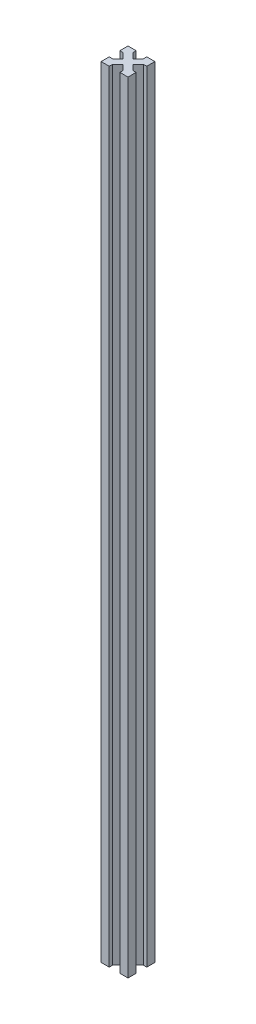
ISO-10303-21;
HEADER;
FILE_DESCRIPTION(('STEP AP214'),'2;1');
FILE_NAME('part.step','',(''),(''),'','','');
FILE_SCHEMA(('AUTOMOTIVE_DESIGN { 1 0 10303 214 1 1 1 1 }'));
ENDSEC;
DATA;
#1=APPLICATION_CONTEXT('core data for automotive mechanical design processes');
#2=APPLICATION_PROTOCOL_DEFINITION('international standard','automotive_design',2000,#1);
#3=PRODUCT_CONTEXT('',#1,'mechanical');
#4=PRODUCT('Part','Part','',(#3));
#5=PRODUCT_RELATED_PRODUCT_CATEGORY('part','',(#4));
#6=PRODUCT_DEFINITION_FORMATION('','',#4);
#7=PRODUCT_DEFINITION_CONTEXT('part definition',#1,'design');
#8=PRODUCT_DEFINITION('design','',#6,#7);
#9=PRODUCT_DEFINITION_SHAPE('','',#8);
#10=(LENGTH_UNIT() NAMED_UNIT(*) SI_UNIT(.MILLI.,.METRE.));
#11=(NAMED_UNIT(*) PLANE_ANGLE_UNIT() SI_UNIT($,.RADIAN.));
#12=(NAMED_UNIT(*) SI_UNIT($,.STERADIAN.) SOLID_ANGLE_UNIT());
#13=UNCERTAINTY_MEASURE_WITH_UNIT(LENGTH_MEASURE(1.E-05),#10,'distance_accuracy_value','');
#14=(GEOMETRIC_REPRESENTATION_CONTEXT(3) GLOBAL_UNCERTAINTY_ASSIGNED_CONTEXT((#13)) GLOBAL_UNIT_ASSIGNED_CONTEXT((#10,
#11,#12)) REPRESENTATION_CONTEXT('',''));
#15=CARTESIAN_POINT('',(0.,0.,0.));
#16=DIRECTION('',(0.,0.,1.));
#17=DIRECTION('',(1.,0.,0.));
#18=AXIS2_PLACEMENT_3D('',#15,#16,#17);
#19=CARTESIAN_POINT('',(-11.7677669529664,580.,-11.7677669529664));
#20=DIRECTION('',(0.707106781186548,0.,0.707106781186547));
#21=DIRECTION('',(0.707106781186547,0.,-0.707106781186548));
#22=AXIS2_PLACEMENT_3D('',#19,#20,#21);
#23=PLANE('',#22);
#24=DIRECTION('',(-0.707106781186547,0.,0.707106781186548));
#25=VECTOR('',#24,1.);
#26=CARTESIAN_POINT('',(-11.7677669529664,0.,-11.7677669529664));
#27=LINE('',#26,#25);
#28=CARTESIAN_POINT('',(-13.5355339059327,0.,-10.));
#29=VERTEX_POINT('',#28);
#30=CARTESIAN_POINT('',(-17.5,0.,-6.03553390593274));
#31=VERTEX_POINT('',#30);
#32=EDGE_CURVE('E231',#29,#31,#27,.T.);
#33=ORIENTED_EDGE('',*,*,#32,.T.);
#34=DIRECTION('',(0.,-1.,0.));
#35=VECTOR('',#34,1.);
#36=CARTESIAN_POINT('',(-17.5,580.,-6.03553390593274));
#37=LINE('',#36,#35);
#38=CARTESIAN_POINT('',(-17.5,580.,-6.03553390593274));
#39=VERTEX_POINT('',#38);
#40=EDGE_CURVE('E11',#39,#31,#37,.T.);
#41=ORIENTED_EDGE('',*,*,#40,.F.);
#42=DIRECTION('',(-0.707106781186547,0.,0.707106781186548));
#43=VECTOR('',#42,1.);
#44=CARTESIAN_POINT('',(-11.7677669529664,580.,-11.7677669529664));
#45=LINE('',#44,#43);
#46=CARTESIAN_POINT('',(-13.5355339059327,580.,-10.));
#47=VERTEX_POINT('',#46);
#48=EDGE_CURVE('E294',#47,#39,#45,.T.);
#49=ORIENTED_EDGE('',*,*,#48,.F.);
#50=DIRECTION('',(0.,-1.,0.));
#51=VECTOR('',#50,1.);
#52=CARTESIAN_POINT('',(-13.5355339059327,580.,-10.));
#53=LINE('',#52,#51);
#54=EDGE_CURVE('E227',#47,#29,#53,.T.);
#55=ORIENTED_EDGE('',*,*,#54,.T.);
#56=EDGE_LOOP('',(#33,#41,#49,#55));
#57=FACE_BOUND('',#56,.T.);
#58=ADVANCED_FACE('F41',(#57),#23,.F.);
#59=CARTESIAN_POINT('',(0.,580.,-6.03553390593274));
#60=DIRECTION('',(0.,0.,1.));
#61=DIRECTION('',(1.,0.,0.));
#62=AXIS2_PLACEMENT_3D('',#59,#60,#61);
#63=PLANE('',#62);
#64=DIRECTION('',(-1.,0.,0.));
#65=VECTOR('',#64,1.);
#66=CARTESIAN_POINT('',(0.,0.,-6.03553390593274));
#67=LINE('',#66,#65);
#68=CARTESIAN_POINT('',(-20.,0.,-6.03553390593274));
#69=VERTEX_POINT('',#68);
#70=EDGE_CURVE('E234',#31,#69,#67,.T.);
#71=ORIENTED_EDGE('',*,*,#70,.T.);
#72=DIRECTION('',(0.,-1.,0.));
#73=VECTOR('',#72,1.);
#74=CARTESIAN_POINT('',(-20.,580.,-6.03553390593274));
#75=LINE('',#74,#73);
#76=CARTESIAN_POINT('',(-20.,580.,-6.03553390593274));
#77=VERTEX_POINT('',#76);
#78=EDGE_CURVE('E49',#77,#69,#75,.T.);
#79=ORIENTED_EDGE('',*,*,#78,.F.);
#80=DIRECTION('',(-1.,0.,0.));
#81=VECTOR('',#80,1.);
#82=CARTESIAN_POINT('',(0.,580.,-6.03553390593274));
#83=LINE('',#82,#81);
#84=EDGE_CURVE('E144',#39,#77,#83,.T.);
#85=ORIENTED_EDGE('',*,*,#84,.F.);
#86=ORIENTED_EDGE('',*,*,#40,.T.);
#87=EDGE_LOOP('',(#71,#79,#85,#86));
#88=FACE_BOUND('',#87,.T.);
#89=ADVANCED_FACE('F343',(#88),#63,.F.);
#90=CARTESIAN_POINT('',(-20.,580.,0.));
#91=DIRECTION('',(-1.,0.,0.));
#92=DIRECTION('',(0.,0.,1.));
#93=AXIS2_PLACEMENT_3D('',#90,#91,#92);
#94=PLANE('',#93);
#95=DIRECTION('',(0.,0.,-1.));
#96=VECTOR('',#95,1.);
#97=CARTESIAN_POINT('',(-20.,0.,0.));
#98=LINE('',#97,#96);
#99=CARTESIAN_POINT('',(-20.,0.,0.));
#100=VERTEX_POINT('',#99);
#101=EDGE_CURVE('E237',#100,#69,#98,.T.);
#102=ORIENTED_EDGE('',*,*,#101,.F.);
#103=DIRECTION('',(0.,-1.,0.));
#104=VECTOR('',#103,1.);
#105=CARTESIAN_POINT('',(-20.,580.,0.));
#106=LINE('',#105,#104);
#107=CARTESIAN_POINT('',(-20.,580.,0.));
#108=VERTEX_POINT('',#107);
#109=EDGE_CURVE('E336',#108,#100,#106,.T.);
#110=ORIENTED_EDGE('',*,*,#109,.F.);
#111=DIRECTION('',(0.,0.,-1.));
#112=VECTOR('',#111,1.);
#113=CARTESIAN_POINT('',(-20.,580.,0.));
#114=LINE('',#113,#112);
#115=EDGE_CURVE('E342',#108,#77,#114,.T.);
#116=ORIENTED_EDGE('',*,*,#115,.T.);
#117=ORIENTED_EDGE('',*,*,#78,.T.);
#118=EDGE_LOOP('',(#102,#110,#116,#117));
#119=FACE_BOUND('',#118,.T.);
#120=ADVANCED_FACE('F340',(#119),#94,.T.);
#121=CARTESIAN_POINT('',(0.,580.,0.));
#122=DIRECTION('',(0.,0.,1.));
#123=DIRECTION('',(1.,0.,0.));
#124=AXIS2_PLACEMENT_3D('',#121,#122,#123);
#125=PLANE('',#124);
#126=DIRECTION('',(-1.,0.,0.));
#127=VECTOR('',#126,1.);
#128=CARTESIAN_POINT('',(0.,0.,0.));
#129=LINE('',#128,#127);
#130=CARTESIAN_POINT('',(-13.9644660940673,0.,0.));
#131=VERTEX_POINT('',#130);
#132=EDGE_CURVE('E240',#131,#100,#129,.T.);
#133=ORIENTED_EDGE('',*,*,#132,.F.);
#134=DIRECTION('',(0.,-1.,0.));
#135=VECTOR('',#134,1.);
#136=CARTESIAN_POINT('',(-13.9644660940673,580.,0.));
#137=LINE('',#136,#135);
#138=CARTESIAN_POINT('',(-13.9644660940673,580.,0.));
#139=VERTEX_POINT('',#138);
#140=EDGE_CURVE('E334',#139,#131,#137,.T.);
#141=ORIENTED_EDGE('',*,*,#140,.F.);
#142=DIRECTION('',(-1.,0.,0.));
#143=VECTOR('',#142,1.);
#144=CARTESIAN_POINT('',(0.,580.,0.));
#145=LINE('',#144,#143);
#146=EDGE_CURVE('E354',#139,#108,#145,.T.);
#147=ORIENTED_EDGE('',*,*,#146,.T.);
#148=ORIENTED_EDGE('',*,*,#109,.T.);
#149=EDGE_LOOP('',(#133,#141,#147,#148));
#150=FACE_BOUND('',#149,.T.);
#151=ADVANCED_FACE('F351',(#150),#125,.T.);
#152=CARTESIAN_POINT('',(-13.9644660940673,580.,0.));
#153=DIRECTION('',(1.,0.,0.));
#154=DIRECTION('',(0.,0.,-1.));
#155=AXIS2_PLACEMENT_3D('',#152,#153,#154);
#156=PLANE('',#155);
#157=DIRECTION('',(0.,0.,1.));
#158=VECTOR('',#157,1.);
#159=CARTESIAN_POINT('',(-13.9644660940673,0.,0.));
#160=LINE('',#159,#158);
#161=CARTESIAN_POINT('',(-13.9644660940673,0.,-2.5));
#162=VERTEX_POINT('',#161);
#163=EDGE_CURVE('E243',#162,#131,#160,.T.);
#164=ORIENTED_EDGE('',*,*,#163,.F.);
#165=DIRECTION('',(0.,-1.,0.));
#166=VECTOR('',#165,1.);
#167=CARTESIAN_POINT('',(-13.9644660940673,580.,-2.5));
#168=LINE('',#167,#166);
#169=CARTESIAN_POINT('',(-13.9644660940673,580.,-2.5));
#170=VERTEX_POINT('',#169);
#171=EDGE_CURVE('E332',#170,#162,#168,.T.);
#172=ORIENTED_EDGE('',*,*,#171,.F.);
#173=DIRECTION('',(0.,0.,1.));
#174=VECTOR('',#173,1.);
#175=CARTESIAN_POINT('',(-13.9644660940673,580.,0.));
#176=LINE('',#175,#174);
#177=EDGE_CURVE('E358',#170,#139,#176,.T.);
#178=ORIENTED_EDGE('',*,*,#177,.T.);
#179=ORIENTED_EDGE('',*,*,#140,.T.);
#180=EDGE_LOOP('',(#164,#172,#178,#179));
#181=FACE_BOUND('',#180,.T.);
#182=ADVANCED_FACE('F432',(#181),#156,.T.);
#183=CARTESIAN_POINT('',(-8.23223304703363,580.,-8.23223304703363));
#184=DIRECTION('',(0.707106781186548,0.,0.707106781186547));
#185=DIRECTION('',(0.707106781186547,0.,-0.707106781186548));
#186=AXIS2_PLACEMENT_3D('',#183,#184,#185);
#187=PLANE('',#186);
#188=DIRECTION('',(-0.707106781186547,0.,0.707106781186548));
#189=VECTOR('',#188,1.);
#190=CARTESIAN_POINT('',(-8.23223304703363,0.,-8.23223304703363));
#191=LINE('',#190,#189);
#192=CARTESIAN_POINT('',(-10.,0.,-6.46446609406726));
#193=VERTEX_POINT('',#192);
#194=EDGE_CURVE('E246',#193,#162,#191,.T.);
#195=ORIENTED_EDGE('',*,*,#194,.F.);
#196=DIRECTION('',(0.,-1.,0.));
#197=VECTOR('',#196,1.);
#198=CARTESIAN_POINT('',(-10.,580.,-6.46446609406726));
#199=LINE('',#198,#197);
#200=CARTESIAN_POINT('',(-10.,580.,-6.46446609406726));
#201=VERTEX_POINT('',#200);
#202=EDGE_CURVE('E330',#201,#193,#199,.T.);
#203=ORIENTED_EDGE('',*,*,#202,.F.);
#204=DIRECTION('',(-0.707106781186547,0.,0.707106781186548));
#205=VECTOR('',#204,1.);
#206=CARTESIAN_POINT('',(-8.23223304703363,580.,-8.23223304703363));
#207=LINE('',#206,#205);
#208=EDGE_CURVE('E364',#201,#170,#207,.T.);
#209=ORIENTED_EDGE('',*,*,#208,.T.);
#210=ORIENTED_EDGE('',*,*,#171,.T.);
#211=EDGE_LOOP('',(#195,#203,#209,#210));
#212=FACE_BOUND('',#211,.T.);
#213=ADVANCED_FACE('F435',(#212),#187,.T.);
#214=CARTESIAN_POINT('',(-1.76776695296637,580.,1.76776695296637));
#215=DIRECTION('',(0.707106781186548,0.,-0.707106781186548));
#216=DIRECTION('',(-0.707106781186548,0.,-0.707106781186548));
#217=AXIS2_PLACEMENT_3D('',#214,#215,#216);
#218=PLANE('',#217);
#219=DIRECTION('',(0.707106781186548,0.,0.707106781186548));
#220=VECTOR('',#219,1.);
#221=CARTESIAN_POINT('',(-1.76776695296637,0.,1.76776695296637));
#222=LINE('',#221,#220);
#223=CARTESIAN_POINT('',(-6.03553390593274,0.,-2.5));
#224=VERTEX_POINT('',#223);
#225=EDGE_CURVE('E249',#193,#224,#222,.T.);
#226=ORIENTED_EDGE('',*,*,#225,.T.);
#227=DIRECTION('',(0.,-1.,0.));
#228=VECTOR('',#227,1.);
#229=CARTESIAN_POINT('',(-6.03553390593274,580.,-2.5));
#230=LINE('',#229,#228);
#231=CARTESIAN_POINT('',(-6.03553390593274,580.,-2.5));
#232=VERTEX_POINT('',#231);
#233=EDGE_CURVE('E327',#232,#224,#230,.T.);
#234=ORIENTED_EDGE('',*,*,#233,.F.);
#235=DIRECTION('',(0.707106781186548,0.,0.707106781186548));
#236=VECTOR('',#235,1.);
#237=CARTESIAN_POINT('',(-1.76776695296637,580.,1.76776695296637));
#238=LINE('',#237,#236);
#239=EDGE_CURVE('E367',#201,#232,#238,.T.);
#240=ORIENTED_EDGE('',*,*,#239,.F.);
#241=ORIENTED_EDGE('',*,*,#202,.T.);
#242=EDGE_LOOP('',(#226,#234,#240,#241));
#243=FACE_BOUND('',#242,.T.);
#244=ADVANCED_FACE('F439',(#243),#218,.F.);
#245=CARTESIAN_POINT('',(-6.03553390593274,580.,0.));
#246=DIRECTION('',(1.,0.,0.));
#247=DIRECTION('',(0.,0.,-1.));
#248=AXIS2_PLACEMENT_3D('',#245,#246,#247);
#249=PLANE('',#248);
#250=DIRECTION('',(0.,0.,1.));
#251=VECTOR('',#250,1.);
#252=CARTESIAN_POINT('',(-6.03553390593274,0.,0.));
#253=LINE('',#252,#251);
#254=CARTESIAN_POINT('',(-6.03553390593274,0.,0.));
#255=VERTEX_POINT('',#254);
#256=EDGE_CURVE('E251',#224,#255,#253,.T.);
#257=ORIENTED_EDGE('',*,*,#256,.T.);
#258=DIRECTION('',(0.,-1.,0.));
#259=VECTOR('',#258,1.);
#260=CARTESIAN_POINT('',(-6.03553390593274,580.,0.));
#261=LINE('',#260,#259);
#262=CARTESIAN_POINT('',(-6.03553390593274,580.,0.));
#263=VERTEX_POINT('',#262);
#264=EDGE_CURVE('E325',#263,#255,#261,.T.);
#265=ORIENTED_EDGE('',*,*,#264,.F.);
#266=DIRECTION('',(0.,0.,1.));
#267=VECTOR('',#266,1.);
#268=CARTESIAN_POINT('',(-6.03553390593274,580.,0.));
#269=LINE('',#268,#267);
#270=EDGE_CURVE('E369',#232,#263,#269,.T.);
#271=ORIENTED_EDGE('',*,*,#270,.F.);
#272=ORIENTED_EDGE('',*,*,#233,.T.);
#273=EDGE_LOOP('',(#257,#265,#271,#272));
#274=FACE_BOUND('',#273,.T.);
#275=ADVANCED_FACE('F443',(#274),#249,.F.);
#276=CARTESIAN_POINT('',(0.,580.,0.));
#277=DIRECTION('',(0.,0.,1.));
#278=DIRECTION('',(1.,0.,0.));
#279=AXIS2_PLACEMENT_3D('',#276,#277,#278);
#280=PLANE('',#279);
#281=DIRECTION('',(-1.,0.,0.));
#282=VECTOR('',#281,1.);
#283=CARTESIAN_POINT('',(0.,0.,0.));
#284=LINE('',#283,#282);
#285=CARTESIAN_POINT('',(0.,0.,0.));
#286=VERTEX_POINT('',#285);
#287=EDGE_CURVE('E254',#286,#255,#284,.T.);
#288=ORIENTED_EDGE('',*,*,#287,.F.);
#289=DIRECTION('',(0.,-1.,0.));
#290=VECTOR('',#289,1.);
#291=CARTESIAN_POINT('',(0.,580.,0.));
#292=LINE('',#291,#290);
#293=CARTESIAN_POINT('',(0.,580.,0.));
#294=VERTEX_POINT('',#293);
#295=EDGE_CURVE('E323',#294,#286,#292,.T.);
#296=ORIENTED_EDGE('',*,*,#295,.F.);
#297=DIRECTION('',(-1.,0.,0.));
#298=VECTOR('',#297,1.);
#299=CARTESIAN_POINT('',(0.,580.,0.));
#300=LINE('',#299,#298);
#301=EDGE_CURVE('E371',#294,#263,#300,.T.);
#302=ORIENTED_EDGE('',*,*,#301,.T.);
#303=ORIENTED_EDGE('',*,*,#264,.T.);
#304=EDGE_LOOP('',(#288,#296,#302,#303));
#305=FACE_BOUND('',#304,.T.);
#306=ADVANCED_FACE('F447',(#305),#280,.T.);
#307=CARTESIAN_POINT('',(0.,580.,0.));
#308=DIRECTION('',(-1.,0.,0.));
#309=DIRECTION('',(0.,0.,1.));
#310=AXIS2_PLACEMENT_3D('',#307,#308,#309);
#311=PLANE('',#310);
#312=DIRECTION('',(0.,0.,-1.));
#313=VECTOR('',#312,1.);
#314=CARTESIAN_POINT('',(0.,0.,0.));
#315=LINE('',#314,#313);
#316=CARTESIAN_POINT('',(0.,0.,-6.03553390593274));
#317=VERTEX_POINT('',#316);
#318=EDGE_CURVE('E257',#286,#317,#315,.T.);
#319=ORIENTED_EDGE('',*,*,#318,.T.);
#320=DIRECTION('',(0.,-1.,0.));
#321=VECTOR('',#320,1.);
#322=CARTESIAN_POINT('',(0.,580.,-6.03553390593274));
#323=LINE('',#322,#321);
#324=CARTESIAN_POINT('',(0.,580.,-6.03553390593274));
#325=VERTEX_POINT('',#324);
#326=EDGE_CURVE('E321',#325,#317,#323,.T.);
#327=ORIENTED_EDGE('',*,*,#326,.F.);
#328=DIRECTION('',(0.,0.,-1.));
#329=VECTOR('',#328,1.);
#330=CARTESIAN_POINT('',(0.,580.,0.));
#331=LINE('',#330,#329);
#332=EDGE_CURVE('E374',#294,#325,#331,.T.);
#333=ORIENTED_EDGE('',*,*,#332,.F.);
#334=ORIENTED_EDGE('',*,*,#295,.T.);
#335=EDGE_LOOP('',(#319,#327,#333,#334));
#336=FACE_BOUND('',#335,.T.);
#337=ADVANCED_FACE('F451',(#336),#311,.F.);
#338=CARTESIAN_POINT('',(0.,580.,-6.03553390593275));
#339=DIRECTION('',(0.,0.,-1.));
#340=DIRECTION('',(-1.,0.,0.));
#341=AXIS2_PLACEMENT_3D('',#338,#339,#340);
#342=PLANE('',#341);
#343=DIRECTION('',(1.,0.,0.));
#344=VECTOR('',#343,1.);
#345=CARTESIAN_POINT('',(0.,0.,-6.03553390593275));
#346=LINE('',#345,#344);
#347=CARTESIAN_POINT('',(-2.5,0.,-6.03553390593275));
#348=VERTEX_POINT('',#347);
#349=EDGE_CURVE('E260',#348,#317,#346,.T.);
#350=ORIENTED_EDGE('',*,*,#349,.F.);
#351=DIRECTION('',(0.,-1.,0.));
#352=VECTOR('',#351,1.);
#353=CARTESIAN_POINT('',(-2.5,580.,-6.03553390593275));
#354=LINE('',#353,#352);
#355=CARTESIAN_POINT('',(-2.5,580.,-6.03553390593275));
#356=VERTEX_POINT('',#355);
#357=EDGE_CURVE('E319',#356,#348,#354,.T.);
#358=ORIENTED_EDGE('',*,*,#357,.F.);
#359=DIRECTION('',(1.,0.,0.));
#360=VECTOR('',#359,1.);
#361=CARTESIAN_POINT('',(0.,580.,-6.03553390593275));
#362=LINE('',#361,#360);
#363=EDGE_CURVE('E376',#356,#325,#362,.T.);
#364=ORIENTED_EDGE('',*,*,#363,.T.);
#365=ORIENTED_EDGE('',*,*,#326,.T.);
#366=EDGE_LOOP('',(#350,#358,#364,#365));
#367=FACE_BOUND('',#366,.T.);
#368=ADVANCED_FACE('F455',(#367),#342,.T.);
#369=CARTESIAN_POINT('',(1.76776695296637,580.,-1.76776695296638));
#370=DIRECTION('',(0.707106781186547,0.,-0.707106781186548));
#371=DIRECTION('',(-0.707106781186548,0.,-0.707106781186547));
#372=AXIS2_PLACEMENT_3D('',#369,#370,#371);
#373=PLANE('',#372);
#374=DIRECTION('',(0.707106781186548,0.,0.707106781186547));
#375=VECTOR('',#374,1.);
#376=CARTESIAN_POINT('',(1.76776695296637,0.,-1.76776695296638));
#377=LINE('',#376,#375);
#378=CARTESIAN_POINT('',(-6.46446609406726,0.,-10.));
#379=VERTEX_POINT('',#378);
#380=EDGE_CURVE('E263',#379,#348,#377,.T.);
#381=ORIENTED_EDGE('',*,*,#380,.F.);
#382=DIRECTION('',(0.,-1.,0.));
#383=VECTOR('',#382,1.);
#384=CARTESIAN_POINT('',(-6.46446609406726,580.,-10.));
#385=LINE('',#384,#383);
#386=CARTESIAN_POINT('',(-6.46446609406726,580.,-10.));
#387=VERTEX_POINT('',#386);
#388=EDGE_CURVE('E317',#387,#379,#385,.T.);
#389=ORIENTED_EDGE('',*,*,#388,.F.);
#390=DIRECTION('',(0.707106781186548,0.,0.707106781186547));
#391=VECTOR('',#390,1.);
#392=CARTESIAN_POINT('',(1.76776695296637,580.,-1.76776695296638));
#393=LINE('',#392,#391);
#394=EDGE_CURVE('E379',#387,#356,#393,.T.);
#395=ORIENTED_EDGE('',*,*,#394,.T.);
#396=ORIENTED_EDGE('',*,*,#357,.T.);
#397=EDGE_LOOP('',(#381,#389,#395,#396));
#398=FACE_BOUND('',#397,.T.);
#399=ADVANCED_FACE('F459',(#398),#373,.T.);
#400=CARTESIAN_POINT('',(-8.23223304703363,580.,-8.23223304703363));
#401=DIRECTION('',(0.707106781186548,0.,0.707106781186547));
#402=DIRECTION('',(0.707106781186547,0.,-0.707106781186548));
#403=AXIS2_PLACEMENT_3D('',#400,#401,#402);
#404=PLANE('',#403);
#405=DIRECTION('',(-0.707106781186547,0.,0.707106781186548));
#406=VECTOR('',#405,1.);
#407=CARTESIAN_POINT('',(-8.23223304703363,0.,-8.23223304703363));
#408=LINE('',#407,#406);
#409=CARTESIAN_POINT('',(-2.5,0.,-13.9644660940673));
#410=VERTEX_POINT('',#409);
#411=EDGE_CURVE('E266',#410,#379,#408,.T.);
#412=ORIENTED_EDGE('',*,*,#411,.F.);
#413=DIRECTION('',(0.,-1.,0.));
#414=VECTOR('',#413,1.);
#415=CARTESIAN_POINT('',(-2.5,580.,-13.9644660940673));
#416=LINE('',#415,#414);
#417=CARTESIAN_POINT('',(-2.5,580.,-13.9644660940673));
#418=VERTEX_POINT('',#417);
#419=EDGE_CURVE('E315',#418,#410,#416,.T.);
#420=ORIENTED_EDGE('',*,*,#419,.F.);
#421=DIRECTION('',(-0.707106781186547,0.,0.707106781186548));
#422=VECTOR('',#421,1.);
#423=CARTESIAN_POINT('',(-8.23223304703363,580.,-8.23223304703363));
#424=LINE('',#423,#422);
#425=EDGE_CURVE('E382',#418,#387,#424,.T.);
#426=ORIENTED_EDGE('',*,*,#425,.T.);
#427=ORIENTED_EDGE('',*,*,#388,.T.);
#428=EDGE_LOOP('',(#412,#420,#426,#427));
#429=FACE_BOUND('',#428,.T.);
#430=ADVANCED_FACE('F463',(#429),#404,.T.);
#431=CARTESIAN_POINT('',(0.,580.,-13.9644660940673));
#432=DIRECTION('',(0.,0.,-1.));
#433=DIRECTION('',(-1.,0.,0.));
#434=AXIS2_PLACEMENT_3D('',#431,#432,#433);
#435=PLANE('',#434);
#436=DIRECTION('',(1.,0.,0.));
#437=VECTOR('',#436,1.);
#438=CARTESIAN_POINT('',(0.,0.,-13.9644660940673));
#439=LINE('',#438,#437);
#440=CARTESIAN_POINT('',(0.,0.,-13.9644660940673));
#441=VERTEX_POINT('',#440);
#442=EDGE_CURVE('E269',#410,#441,#439,.T.);
#443=ORIENTED_EDGE('',*,*,#442,.T.);
#444=DIRECTION('',(0.,-1.,0.));
#445=VECTOR('',#444,1.);
#446=CARTESIAN_POINT('',(0.,580.,-13.9644660940673));
#447=LINE('',#446,#445);
#448=CARTESIAN_POINT('',(0.,580.,-13.9644660940673));
#449=VERTEX_POINT('',#448);
#450=EDGE_CURVE('E312',#449,#441,#447,.T.);
#451=ORIENTED_EDGE('',*,*,#450,.F.);
#452=DIRECTION('',(1.,0.,0.));
#453=VECTOR('',#452,1.);
#454=CARTESIAN_POINT('',(0.,580.,-13.9644660940673));
#455=LINE('',#454,#453);
#456=EDGE_CURVE('E385',#418,#449,#455,.T.);
#457=ORIENTED_EDGE('',*,*,#456,.F.);
#458=ORIENTED_EDGE('',*,*,#419,.T.);
#459=EDGE_LOOP('',(#443,#451,#457,#458));
#460=FACE_BOUND('',#459,.T.);
#461=ADVANCED_FACE('F467',(#460),#435,.F.);
#462=CARTESIAN_POINT('',(0.,580.,0.));
#463=DIRECTION('',(-1.,0.,0.));
#464=DIRECTION('',(0.,0.,1.));
#465=AXIS2_PLACEMENT_3D('',#462,#463,#464);
#466=PLANE('',#465);
#467=DIRECTION('',(0.,0.,-1.));
#468=VECTOR('',#467,1.);
#469=CARTESIAN_POINT('',(0.,0.,0.));
#470=LINE('',#469,#468);
#471=CARTESIAN_POINT('',(0.,0.,-20.));
#472=VERTEX_POINT('',#471);
#473=EDGE_CURVE('E271',#441,#472,#470,.T.);
#474=ORIENTED_EDGE('',*,*,#473,.T.);
#475=DIRECTION('',(0.,-1.,0.));
#476=VECTOR('',#475,1.);
#477=CARTESIAN_POINT('',(0.,580.,-20.));
#478=LINE('',#477,#476);
#479=CARTESIAN_POINT('',(0.,580.,-20.));
#480=VERTEX_POINT('',#479);
#481=EDGE_CURVE('E309',#480,#472,#478,.T.);
#482=ORIENTED_EDGE('',*,*,#481,.F.);
#483=DIRECTION('',(0.,0.,-1.));
#484=VECTOR('',#483,1.);
#485=CARTESIAN_POINT('',(0.,580.,0.));
#486=LINE('',#485,#484);
#487=EDGE_CURVE('E387',#449,#480,#486,.T.);
#488=ORIENTED_EDGE('',*,*,#487,.F.);
#489=ORIENTED_EDGE('',*,*,#450,.T.);
#490=EDGE_LOOP('',(#474,#482,#488,#489));
#491=FACE_BOUND('',#490,.T.);
#492=ADVANCED_FACE('F471',(#491),#466,.F.);
#493=CARTESIAN_POINT('',(0.,580.,-20.));
#494=DIRECTION('',(0.,0.,1.));
#495=DIRECTION('',(1.,0.,0.));
#496=AXIS2_PLACEMENT_3D('',#493,#494,#495);
#497=PLANE('',#496);
#498=DIRECTION('',(-1.,0.,0.));
#499=VECTOR('',#498,1.);
#500=CARTESIAN_POINT('',(0.,0.,-20.));
#501=LINE('',#500,#499);
#502=CARTESIAN_POINT('',(-6.03553390593274,0.,-20.));
#503=VERTEX_POINT('',#502);
#504=EDGE_CURVE('E273',#472,#503,#501,.T.);
#505=ORIENTED_EDGE('',*,*,#504,.T.);
#506=DIRECTION('',(0.,-1.,0.));
#507=VECTOR('',#506,1.);
#508=CARTESIAN_POINT('',(-6.03553390593274,580.,-20.));
#509=LINE('',#508,#507);
#510=CARTESIAN_POINT('',(-6.03553390593274,580.,-20.));
#511=VERTEX_POINT('',#510);
#512=EDGE_CURVE('E307',#511,#503,#509,.T.);
#513=ORIENTED_EDGE('',*,*,#512,.F.);
#514=DIRECTION('',(-1.,0.,0.));
#515=VECTOR('',#514,1.);
#516=CARTESIAN_POINT('',(0.,580.,-20.));
#517=LINE('',#516,#515);
#518=EDGE_CURVE('E389',#480,#511,#517,.T.);
#519=ORIENTED_EDGE('',*,*,#518,.F.);
#520=ORIENTED_EDGE('',*,*,#481,.T.);
#521=EDGE_LOOP('',(#505,#513,#519,#520));
#522=FACE_BOUND('',#521,.T.);
#523=ADVANCED_FACE('F475',(#522),#497,.F.);
#524=CARTESIAN_POINT('',(-6.03553390593275,580.,0.));
#525=DIRECTION('',(-1.,0.,0.));
#526=DIRECTION('',(0.,0.,1.));
#527=AXIS2_PLACEMENT_3D('',#524,#525,#526);
#528=PLANE('',#527);
#529=DIRECTION('',(0.,0.,-1.));
#530=VECTOR('',#529,1.);
#531=CARTESIAN_POINT('',(-6.03553390593275,0.,0.));
#532=LINE('',#531,#530);
#533=CARTESIAN_POINT('',(-6.03553390593274,0.,-17.5));
#534=VERTEX_POINT('',#533);
#535=EDGE_CURVE('E276',#534,#503,#532,.T.);
#536=ORIENTED_EDGE('',*,*,#535,.F.);
#537=DIRECTION('',(0.,-1.,0.));
#538=VECTOR('',#537,1.);
#539=CARTESIAN_POINT('',(-6.03553390593274,580.,-17.5));
#540=LINE('',#539,#538);
#541=CARTESIAN_POINT('',(-6.03553390593274,580.,-17.5));
#542=VERTEX_POINT('',#541);
#543=EDGE_CURVE('E305',#542,#534,#540,.T.);
#544=ORIENTED_EDGE('',*,*,#543,.F.);
#545=DIRECTION('',(0.,0.,-1.));
#546=VECTOR('',#545,1.);
#547=CARTESIAN_POINT('',(-6.03553390593275,580.,0.));
#548=LINE('',#547,#546);
#549=EDGE_CURVE('E391',#542,#511,#548,.T.);
#550=ORIENTED_EDGE('',*,*,#549,.T.);
#551=ORIENTED_EDGE('',*,*,#512,.T.);
#552=EDGE_LOOP('',(#536,#544,#550,#551));
#553=FACE_BOUND('',#552,.T.);
#554=ADVANCED_FACE('F479',(#553),#528,.T.);
#555=CARTESIAN_POINT('',(-11.7677669529664,580.,-11.7677669529664));
#556=DIRECTION('',(0.707106781186548,0.,0.707106781186547));
#557=DIRECTION('',(0.707106781186547,0.,-0.707106781186548));
#558=AXIS2_PLACEMENT_3D('',#555,#556,#557);
#559=PLANE('',#558);
#560=DIRECTION('',(-0.707106781186547,0.,0.707106781186548));
#561=VECTOR('',#560,1.);
#562=CARTESIAN_POINT('',(-11.7677669529664,0.,-11.7677669529664));
#563=LINE('',#562,#561);
#564=CARTESIAN_POINT('',(-10.,0.,-13.5355339059327));
#565=VERTEX_POINT('',#564);
#566=EDGE_CURVE('E279',#534,#565,#563,.T.);
#567=ORIENTED_EDGE('',*,*,#566,.T.);
#568=DIRECTION('',(0.,-1.,0.));
#569=VECTOR('',#568,1.);
#570=CARTESIAN_POINT('',(-10.,580.,-13.5355339059327));
#571=LINE('',#570,#569);
#572=CARTESIAN_POINT('',(-10.,580.,-13.5355339059327));
#573=VERTEX_POINT('',#572);
#574=EDGE_CURVE('E303',#573,#565,#571,.T.);
#575=ORIENTED_EDGE('',*,*,#574,.F.);
#576=DIRECTION('',(-0.707106781186547,0.,0.707106781186548));
#577=VECTOR('',#576,1.);
#578=CARTESIAN_POINT('',(-11.7677669529664,580.,-11.7677669529664));
#579=LINE('',#578,#577);
#580=EDGE_CURVE('E394',#542,#573,#579,.T.);
#581=ORIENTED_EDGE('',*,*,#580,.F.);
#582=ORIENTED_EDGE('',*,*,#543,.T.);
#583=EDGE_LOOP('',(#567,#575,#581,#582));
#584=FACE_BOUND('',#583,.T.);
#585=ADVANCED_FACE('F483',(#584),#559,.F.);
#586=CARTESIAN_POINT('',(1.76776695296637,580.,-1.76776695296638));
#587=DIRECTION('',(0.707106781186547,0.,-0.707106781186548));
#588=DIRECTION('',(-0.707106781186548,0.,-0.707106781186547));
#589=AXIS2_PLACEMENT_3D('',#586,#587,#588);
#590=PLANE('',#589);
#591=DIRECTION('',(0.707106781186548,0.,0.707106781186547));
#592=VECTOR('',#591,1.);
#593=CARTESIAN_POINT('',(1.76776695296637,0.,-1.76776695296638));
#594=LINE('',#593,#592);
#595=CARTESIAN_POINT('',(-13.9644660940673,0.,-17.5));
#596=VERTEX_POINT('',#595);
#597=EDGE_CURVE('E282',#596,#565,#594,.T.);
#598=ORIENTED_EDGE('',*,*,#597,.F.);
#599=DIRECTION('',(0.,-1.,0.));
#600=VECTOR('',#599,1.);
#601=CARTESIAN_POINT('',(-13.9644660940673,580.,-17.5));
#602=LINE('',#601,#600);
#603=CARTESIAN_POINT('',(-13.9644660940673,580.,-17.5));
#604=VERTEX_POINT('',#603);
#605=EDGE_CURVE('E301',#604,#596,#602,.T.);
#606=ORIENTED_EDGE('',*,*,#605,.F.);
#607=DIRECTION('',(0.707106781186548,0.,0.707106781186547));
#608=VECTOR('',#607,1.);
#609=CARTESIAN_POINT('',(1.76776695296637,580.,-1.76776695296638));
#610=LINE('',#609,#608);
#611=EDGE_CURVE('E396',#604,#573,#610,.T.);
#612=ORIENTED_EDGE('',*,*,#611,.T.);
#613=ORIENTED_EDGE('',*,*,#574,.T.);
#614=EDGE_LOOP('',(#598,#606,#612,#613));
#615=FACE_BOUND('',#614,.T.);
#616=ADVANCED_FACE('F487',(#615),#590,.T.);
#617=CARTESIAN_POINT('',(-13.9644660940672,580.,0.));
#618=DIRECTION('',(-1.,0.,0.));
#619=DIRECTION('',(0.,0.,1.));
#620=AXIS2_PLACEMENT_3D('',#617,#618,#619);
#621=PLANE('',#620);
#622=DIRECTION('',(0.,0.,-1.));
#623=VECTOR('',#622,1.);
#624=CARTESIAN_POINT('',(-13.9644660940672,0.,0.));
#625=LINE('',#624,#623);
#626=CARTESIAN_POINT('',(-13.9644660940673,0.,-20.));
#627=VERTEX_POINT('',#626);
#628=EDGE_CURVE('E285',#596,#627,#625,.T.);
#629=ORIENTED_EDGE('',*,*,#628,.T.);
#630=DIRECTION('',(0.,-1.,0.));
#631=VECTOR('',#630,1.);
#632=CARTESIAN_POINT('',(-13.9644660940673,580.,-20.));
#633=LINE('',#632,#631);
#634=CARTESIAN_POINT('',(-13.9644660940673,580.,-20.));
#635=VERTEX_POINT('',#634);
#636=EDGE_CURVE('E298',#635,#627,#633,.T.);
#637=ORIENTED_EDGE('',*,*,#636,.F.);
#638=DIRECTION('',(0.,0.,-1.));
#639=VECTOR('',#638,1.);
#640=CARTESIAN_POINT('',(-13.9644660940672,580.,0.));
#641=LINE('',#640,#639);
#642=EDGE_CURVE('E399',#604,#635,#641,.T.);
#643=ORIENTED_EDGE('',*,*,#642,.F.);
#644=ORIENTED_EDGE('',*,*,#605,.T.);
#645=EDGE_LOOP('',(#629,#637,#643,#644));
#646=FACE_BOUND('',#645,.T.);
#647=ADVANCED_FACE('F404',(#646),#621,.F.);
#648=CARTESIAN_POINT('',(0.,580.,-20.));
#649=DIRECTION('',(0.,0.,1.));
#650=DIRECTION('',(1.,0.,0.));
#651=AXIS2_PLACEMENT_3D('',#648,#649,#650);
#652=PLANE('',#651);
#653=DIRECTION('',(-1.,0.,0.));
#654=VECTOR('',#653,1.);
#655=CARTESIAN_POINT('',(0.,0.,-20.));
#656=LINE('',#655,#654);
#657=CARTESIAN_POINT('',(-20.,0.,-20.));
#658=VERTEX_POINT('',#657);
#659=EDGE_CURVE('E287',#627,#658,#656,.T.);
#660=ORIENTED_EDGE('',*,*,#659,.T.);
#661=DIRECTION('',(0.,-1.,0.));
#662=VECTOR('',#661,1.);
#663=CARTESIAN_POINT('',(-20.,580.,-20.));
#664=LINE('',#663,#662);
#665=CARTESIAN_POINT('',(-20.,580.,-20.));
#666=VERTEX_POINT('',#665);
#667=EDGE_CURVE('E217',#666,#658,#664,.T.);
#668=ORIENTED_EDGE('',*,*,#667,.F.);
#669=DIRECTION('',(-1.,0.,0.));
#670=VECTOR('',#669,1.);
#671=CARTESIAN_POINT('',(0.,580.,-20.));
#672=LINE('',#671,#670);
#673=EDGE_CURVE('E222',#635,#666,#672,.T.);
#674=ORIENTED_EDGE('',*,*,#673,.F.);
#675=ORIENTED_EDGE('',*,*,#636,.T.);
#676=EDGE_LOOP('',(#660,#668,#674,#675));
#677=FACE_BOUND('',#676,.T.);
#678=ADVANCED_FACE('F408',(#677),#652,.F.);
#679=CARTESIAN_POINT('',(-20.,580.,0.));
#680=DIRECTION('',(-1.,0.,0.));
#681=DIRECTION('',(0.,0.,1.));
#682=AXIS2_PLACEMENT_3D('',#679,#680,#681);
#683=PLANE('',#682);
#684=DIRECTION('',(0.,0.,-1.));
#685=VECTOR('',#684,1.);
#686=CARTESIAN_POINT('',(-20.,0.,0.));
#687=LINE('',#686,#685);
#688=CARTESIAN_POINT('',(-20.,0.,-13.9644660940673));
#689=VERTEX_POINT('',#688);
#690=EDGE_CURVE('E212',#689,#658,#687,.T.);
#691=ORIENTED_EDGE('',*,*,#690,.F.);
#692=DIRECTION('',(0.,-1.,0.));
#693=VECTOR('',#692,1.);
#694=CARTESIAN_POINT('',(-20.,580.,-13.9644660940673));
#695=LINE('',#694,#693);
#696=CARTESIAN_POINT('',(-20.,580.,-13.9644660940673));
#697=VERTEX_POINT('',#696);
#698=EDGE_CURVE('E207',#697,#689,#695,.T.);
#699=ORIENTED_EDGE('',*,*,#698,.F.);
#700=DIRECTION('',(0.,0.,-1.));
#701=VECTOR('',#700,1.);
#702=CARTESIAN_POINT('',(-20.,580.,0.));
#703=LINE('',#702,#701);
#704=EDGE_CURVE('E210',#697,#666,#703,.T.);
#705=ORIENTED_EDGE('',*,*,#704,.T.);
#706=ORIENTED_EDGE('',*,*,#667,.T.);
#707=EDGE_LOOP('',(#691,#699,#705,#706));
#708=FACE_BOUND('',#707,.T.);
#709=ADVANCED_FACE('F209',(#708),#683,.T.);
#710=CARTESIAN_POINT('',(0.,580.,-13.9644660940673));
#711=DIRECTION('',(0.,0.,1.));
#712=DIRECTION('',(1.,0.,0.));
#713=AXIS2_PLACEMENT_3D('',#710,#711,#712);
#714=PLANE('',#713);
#715=DIRECTION('',(-1.,0.,0.));
#716=VECTOR('',#715,1.);
#717=CARTESIAN_POINT('',(0.,0.,-13.9644660940673));
#718=LINE('',#717,#716);
#719=CARTESIAN_POINT('',(-17.5,0.,-13.9644660940673));
#720=VERTEX_POINT('',#719);
#721=EDGE_CURVE('E291',#720,#689,#718,.T.);
#722=ORIENTED_EDGE('',*,*,#721,.F.);
#723=DIRECTION('',(0.,-1.,0.));
#724=VECTOR('',#723,1.);
#725=CARTESIAN_POINT('',(-17.5,580.,-13.9644660940673));
#726=LINE('',#725,#724);
#727=CARTESIAN_POINT('',(-17.5,580.,-13.9644660940673));
#728=VERTEX_POINT('',#727);
#729=EDGE_CURVE('E133',#728,#720,#726,.T.);
#730=ORIENTED_EDGE('',*,*,#729,.F.);
#731=DIRECTION('',(-1.,0.,0.));
#732=VECTOR('',#731,1.);
#733=CARTESIAN_POINT('',(0.,580.,-13.9644660940673));
#734=LINE('',#733,#732);
#735=EDGE_CURVE('E220',#728,#697,#734,.T.);
#736=ORIENTED_EDGE('',*,*,#735,.T.);
#737=ORIENTED_EDGE('',*,*,#698,.T.);
#738=EDGE_LOOP('',(#722,#730,#736,#737));
#739=FACE_BOUND('',#738,.T.);
#740=ADVANCED_FACE('F225',(#739),#714,.T.);
#741=CARTESIAN_POINT('',(-1.76776695296637,580.,1.76776695296637));
#742=DIRECTION('',(0.707106781186548,0.,-0.707106781186548));
#743=DIRECTION('',(-0.707106781186548,0.,-0.707106781186548));
#744=AXIS2_PLACEMENT_3D('',#741,#742,#743);
#745=PLANE('',#744);
#746=DIRECTION('',(0.707106781186548,0.,0.707106781186548));
#747=VECTOR('',#746,1.);
#748=CARTESIAN_POINT('',(-1.76776695296637,0.,1.76776695296637));
#749=LINE('',#748,#747);
#750=EDGE_CURVE('E136',#720,#29,#749,.T.);
#751=ORIENTED_EDGE('',*,*,#750,.T.);
#752=ORIENTED_EDGE('',*,*,#54,.F.);
#753=DIRECTION('',(0.707106781186548,0.,0.707106781186548));
#754=VECTOR('',#753,1.);
#755=CARTESIAN_POINT('',(-1.76776695296637,580.,1.76776695296637));
#756=LINE('',#755,#754);
#757=EDGE_CURVE('E57',#728,#47,#756,.T.);
#758=ORIENTED_EDGE('',*,*,#757,.F.);
#759=ORIENTED_EDGE('',*,*,#729,.T.);
#760=EDGE_LOOP('',(#751,#752,#758,#759));
#761=FACE_BOUND('',#760,.T.);
#762=ADVANCED_FACE('F411',(#761),#745,.F.);
#763=CARTESIAN_POINT('',(0.,580.,0.));
#764=DIRECTION('',(0.,1.,0.));
#765=DIRECTION('',(0.,0.,1.));
#766=AXIS2_PLACEMENT_3D('',#763,#764,#765);
#767=PLANE('',#766);
#768=ORIENTED_EDGE('',*,*,#48,.T.);
#769=ORIENTED_EDGE('',*,*,#84,.T.);
#770=ORIENTED_EDGE('',*,*,#115,.F.);
#771=ORIENTED_EDGE('',*,*,#146,.F.);
#772=ORIENTED_EDGE('',*,*,#177,.F.);
#773=ORIENTED_EDGE('',*,*,#208,.F.);
#774=ORIENTED_EDGE('',*,*,#239,.T.);
#775=ORIENTED_EDGE('',*,*,#270,.T.);
#776=ORIENTED_EDGE('',*,*,#301,.F.);
#777=ORIENTED_EDGE('',*,*,#332,.T.);
#778=ORIENTED_EDGE('',*,*,#363,.F.);
#779=ORIENTED_EDGE('',*,*,#394,.F.);
#780=ORIENTED_EDGE('',*,*,#425,.F.);
#781=ORIENTED_EDGE('',*,*,#456,.T.);
#782=ORIENTED_EDGE('',*,*,#487,.T.);
#783=ORIENTED_EDGE('',*,*,#518,.T.);
#784=ORIENTED_EDGE('',*,*,#549,.F.);
#785=ORIENTED_EDGE('',*,*,#580,.T.);
#786=ORIENTED_EDGE('',*,*,#611,.F.);
#787=ORIENTED_EDGE('',*,*,#642,.T.);
#788=ORIENTED_EDGE('',*,*,#673,.T.);
#789=ORIENTED_EDGE('',*,*,#704,.F.);
#790=ORIENTED_EDGE('',*,*,#735,.F.);
#791=ORIENTED_EDGE('',*,*,#757,.T.);
#792=EDGE_LOOP('',(#768,#769,#770,#771,#772,#773,#774,#775,#776,#777,#778,#779,#780,#781,#782,
#783,#784,#785,#786,#787,#788,#789,#790,#791));
#793=FACE_BOUND('',#792,.T.);
#794=ADVANCED_FACE('F219',(#793),#767,.T.);
#795=CARTESIAN_POINT('',(0.,0.,0.));
#796=DIRECTION('',(0.,1.,0.));
#797=DIRECTION('',(0.,0.,1.));
#798=AXIS2_PLACEMENT_3D('',#795,#796,#797);
#799=PLANE('',#798);
#800=ORIENTED_EDGE('',*,*,#32,.F.);
#801=ORIENTED_EDGE('',*,*,#750,.F.);
#802=ORIENTED_EDGE('',*,*,#721,.T.);
#803=ORIENTED_EDGE('',*,*,#690,.T.);
#804=ORIENTED_EDGE('',*,*,#659,.F.);
#805=ORIENTED_EDGE('',*,*,#628,.F.);
#806=ORIENTED_EDGE('',*,*,#597,.T.);
#807=ORIENTED_EDGE('',*,*,#566,.F.);
#808=ORIENTED_EDGE('',*,*,#535,.T.);
#809=ORIENTED_EDGE('',*,*,#504,.F.);
#810=ORIENTED_EDGE('',*,*,#473,.F.);
#811=ORIENTED_EDGE('',*,*,#442,.F.);
#812=ORIENTED_EDGE('',*,*,#411,.T.);
#813=ORIENTED_EDGE('',*,*,#380,.T.);
#814=ORIENTED_EDGE('',*,*,#349,.T.);
#815=ORIENTED_EDGE('',*,*,#318,.F.);
#816=ORIENTED_EDGE('',*,*,#287,.T.);
#817=ORIENTED_EDGE('',*,*,#256,.F.);
#818=ORIENTED_EDGE('',*,*,#225,.F.);
#819=ORIENTED_EDGE('',*,*,#194,.T.);
#820=ORIENTED_EDGE('',*,*,#163,.T.);
#821=ORIENTED_EDGE('',*,*,#132,.T.);
#822=ORIENTED_EDGE('',*,*,#101,.T.);
#823=ORIENTED_EDGE('',*,*,#70,.F.);
#824=EDGE_LOOP('',(#800,#801,#802,#803,#804,#805,#806,#807,#808,#809,#810,#811,#812,#813,#814,
#815,#816,#817,#818,#819,#820,#821,#822,#823));
#825=FACE_BOUND('',#824,.T.);
#826=ADVANCED_FACE('F347',(#825),#799,.F.);
#827=CLOSED_SHELL('',(#58,#89,#120,#151,#182,#213,#244,#275,#306,#337,#368,#399,#430,#461,#492,
#523,#554,#585,#616,#647,#678,#709,#740,#762,#794,#826));
#828=MANIFOLD_SOLID_BREP('B2',#827);
#829=ADVANCED_BREP_SHAPE_REPRESENTATION('',(#18,#828),#14);
#830=SHAPE_DEFINITION_REPRESENTATION(#9,#829);
ENDSEC;
END-ISO-10303-21;
